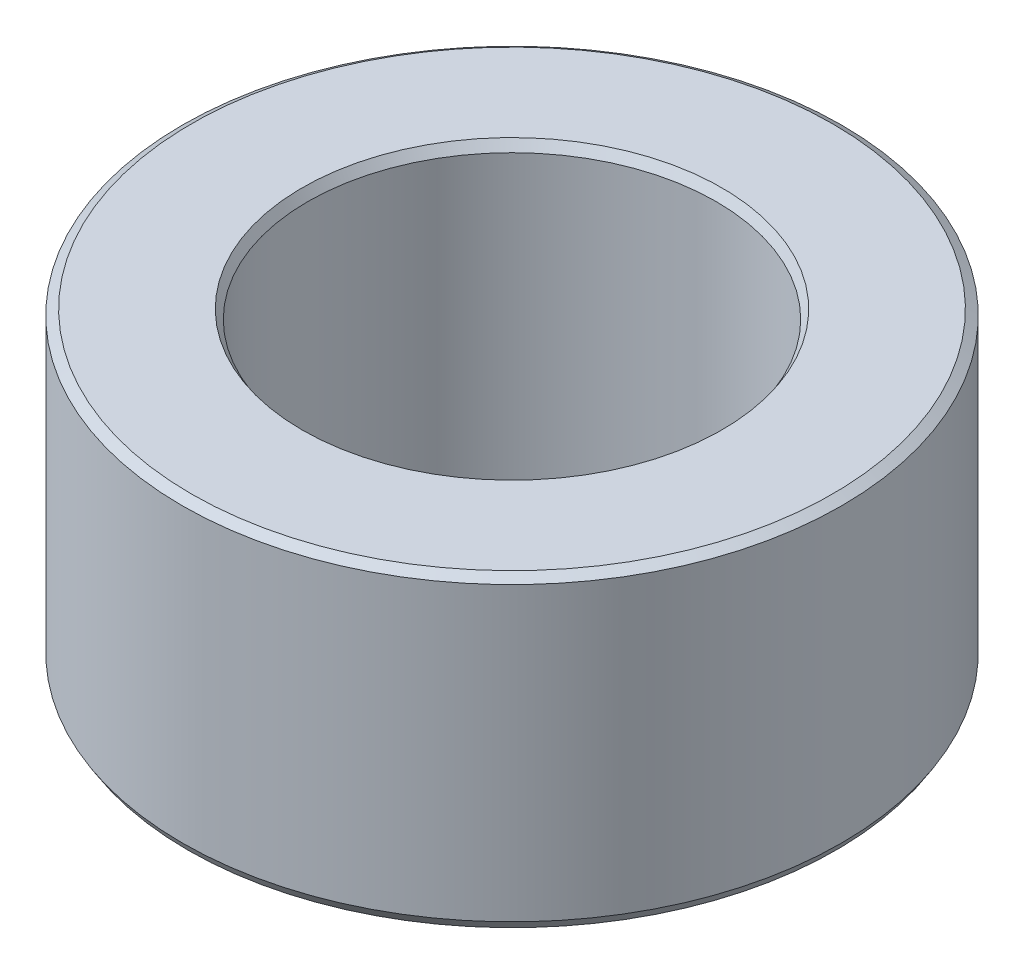
ISO-10303-21;
HEADER;
FILE_DESCRIPTION(('STEP AP214'),'2;1');
FILE_NAME('part.step','',(''),(''),'','','');
FILE_SCHEMA(('AUTOMOTIVE_DESIGN { 1 0 10303 214 1 1 1 1 }'));
ENDSEC;
DATA;
#1=APPLICATION_CONTEXT('core data for automotive mechanical design processes');
#2=APPLICATION_PROTOCOL_DEFINITION('international standard','automotive_design',2000,#1);
#3=PRODUCT_CONTEXT('',#1,'mechanical');
#4=PRODUCT('Part','Part','',(#3));
#5=PRODUCT_RELATED_PRODUCT_CATEGORY('part','',(#4));
#6=PRODUCT_DEFINITION_FORMATION('','',#4);
#7=PRODUCT_DEFINITION_CONTEXT('part definition',#1,'design');
#8=PRODUCT_DEFINITION('design','',#6,#7);
#9=PRODUCT_DEFINITION_SHAPE('','',#8);
#10=(LENGTH_UNIT() NAMED_UNIT(*) SI_UNIT(.MILLI.,.METRE.));
#11=(NAMED_UNIT(*) PLANE_ANGLE_UNIT() SI_UNIT($,.RADIAN.));
#12=(NAMED_UNIT(*) SI_UNIT($,.STERADIAN.) SOLID_ANGLE_UNIT());
#13=UNCERTAINTY_MEASURE_WITH_UNIT(LENGTH_MEASURE(1.E-05),#10,'distance_accuracy_value','');
#14=(GEOMETRIC_REPRESENTATION_CONTEXT(3) GLOBAL_UNCERTAINTY_ASSIGNED_CONTEXT((#13)) GLOBAL_UNIT_ASSIGNED_CONTEXT((#10,
#11,#12)) REPRESENTATION_CONTEXT('',''));
#15=CARTESIAN_POINT('',(0.,0.,0.));
#16=DIRECTION('',(0.,0.,1.));
#17=DIRECTION('',(1.,0.,0.));
#18=AXIS2_PLACEMENT_3D('',#15,#16,#17);
#19=CARTESIAN_POINT('',(0.,46.5250636387127,0.));
#20=DIRECTION('',(0.,-1.,0.));
#21=DIRECTION('',(0.,0.,-1.));
#22=AXIS2_PLACEMENT_3D('',#19,#20,#21);
#23=CYLINDRICAL_SURFACE('',#22,50.);
#24=CARTESIAN_POINT('',(0.,1.37868026472085,0.));
#25=DIRECTION('',(0.,1.,0.));
#26=DIRECTION('',(0.,0.,1.));
#27=AXIS2_PLACEMENT_3D('',#24,#25,#26);
#28=CIRCLE('',#27,50.);
#29=CARTESIAN_POINT('',(0.,1.37868026472085,50.));
#30=VERTEX_POINT('',#29);
#31=EDGE_CURVE('E10',#30,#30,#28,.T.);
#32=ORIENTED_EDGE('',*,*,#31,.T.);
#33=EDGE_LOOP('',(#32));
#34=FACE_BOUND('',#33,.T.);
#35=CARTESIAN_POINT('',(0.,45.666382704719,0.));
#36=DIRECTION('',(0.,1.,0.));
#37=DIRECTION('',(0.,0.,1.));
#38=AXIS2_PLACEMENT_3D('',#35,#36,#37);
#39=CIRCLE('',#38,50.);
#40=CARTESIAN_POINT('',(0.,45.666382704719,50.));
#41=VERTEX_POINT('',#40);
#42=EDGE_CURVE('E50',#41,#41,#39,.F.);
#43=ORIENTED_EDGE('',*,*,#42,.T.);
#44=EDGE_LOOP('',(#43));
#45=FACE_BOUND('',#44,.T.);
#46=ADVANCED_FACE('F39',(#34,#45),#23,.T.);
#47=CARTESIAN_POINT('',(0.,46.5250636387127,0.));
#48=DIRECTION('',(0.,1.,0.));
#49=DIRECTION('',(0.,0.,1.));
#50=AXIS2_PLACEMENT_3D('',#47,#48,#49);
#51=PLANE('',#50);
#52=CARTESIAN_POINT('',(0.,46.5250636387127,0.));
#53=DIRECTION('',(0.,1.,0.));
#54=DIRECTION('',(0.,0.,1.));
#55=AXIS2_PLACEMENT_3D('',#52,#53,#54);
#56=CIRCLE('',#55,31.8210176963023);
#57=CARTESIAN_POINT('',(0.,46.5250636387127,31.8210176963023));
#58=VERTEX_POINT('',#57);
#59=EDGE_CURVE('E58',#58,#58,#56,.F.);
#60=ORIENTED_EDGE('',*,*,#59,.T.);
#61=EDGE_LOOP('',(#60));
#62=FACE_BOUND('',#61,.T.);
#63=CARTESIAN_POINT('',(0.,46.5250636387127,0.));
#64=DIRECTION('',(0.,1.,0.));
#65=DIRECTION('',(0.,0.,1.));
#66=AXIS2_PLACEMENT_3D('',#63,#64,#65);
#67=CIRCLE('',#66,48.6213197352792);
#68=CARTESIAN_POINT('',(0.,46.5250636387127,48.6213197352792));
#69=VERTEX_POINT('',#68);
#70=EDGE_CURVE('E61',#69,#69,#67,.T.);
#71=ORIENTED_EDGE('',*,*,#70,.T.);
#72=EDGE_LOOP('',(#71));
#73=FACE_BOUND('',#72,.T.);
#74=ADVANCED_FACE('F88',(#62,#73),#51,.T.);
#75=CARTESIAN_POINT('',(0.,0.,0.));
#76=DIRECTION('',(0.,1.,0.));
#77=DIRECTION('',(0.,0.,1.));
#78=AXIS2_PLACEMENT_3D('',#75,#76,#77);
#79=PLANE('',#78);
#80=CARTESIAN_POINT('',(0.,0.,0.));
#81=DIRECTION('',(0.,1.,0.));
#82=DIRECTION('',(0.,0.,1.));
#83=AXIS2_PLACEMENT_3D('',#80,#81,#82);
#84=CIRCLE('',#83,32.3410170270295);
#85=CARTESIAN_POINT('',(0.,0.,32.3410170270295));
#86=VERTEX_POINT('',#85);
#87=EDGE_CURVE('E51',#86,#86,#84,.T.);
#88=ORIENTED_EDGE('',*,*,#87,.T.);
#89=EDGE_LOOP('',(#88));
#90=FACE_BOUND('',#89,.T.);
#91=CARTESIAN_POINT('',(0.,0.,0.));
#92=DIRECTION('',(0.,1.,0.));
#93=DIRECTION('',(0.,0.,1.));
#94=AXIS2_PLACEMENT_3D('',#91,#92,#93);
#95=CIRCLE('',#94,49.1413190660063);
#96=CARTESIAN_POINT('',(0.,0.,49.1413190660063));
#97=VERTEX_POINT('',#96);
#98=EDGE_CURVE('E54',#97,#97,#95,.F.);
#99=ORIENTED_EDGE('',*,*,#98,.T.);
#100=EDGE_LOOP('',(#99));
#101=FACE_BOUND('',#100,.T.);
#102=ADVANCED_FACE('F83',(#90,#101),#79,.F.);
#103=CARTESIAN_POINT('',(0.,46.5250636387127,0.));
#104=DIRECTION('',(0.,-1.,0.));
#105=DIRECTION('',(0.,0.,-1.));
#106=AXIS2_PLACEMENT_3D('',#103,#104,#105);
#107=CYLINDRICAL_SURFACE('',#106,30.9623367623087);
#108=CARTESIAN_POINT('',(0.,45.1463833739918,0.));
#109=DIRECTION('',(0.,1.,0.));
#110=DIRECTION('',(0.,0.,1.));
#111=AXIS2_PLACEMENT_3D('',#108,#109,#110);
#112=CIRCLE('',#111,30.9623367623087);
#113=CARTESIAN_POINT('',(0.,45.1463833739918,30.9623367623087));
#114=VERTEX_POINT('',#113);
#115=EDGE_CURVE('E67',#114,#114,#112,.T.);
#116=ORIENTED_EDGE('',*,*,#115,.T.);
#117=EDGE_LOOP('',(#116));
#118=FACE_BOUND('',#117,.T.);
#119=CARTESIAN_POINT('',(0.,0.858680933993647,0.));
#120=DIRECTION('',(0.,1.,0.));
#121=DIRECTION('',(0.,0.,1.));
#122=AXIS2_PLACEMENT_3D('',#119,#120,#121);
#123=CIRCLE('',#122,30.9623367623087);
#124=CARTESIAN_POINT('',(0.,0.858680933993647,30.9623367623087));
#125=VERTEX_POINT('',#124);
#126=EDGE_CURVE('E69',#125,#125,#123,.F.);
#127=ORIENTED_EDGE('',*,*,#126,.T.);
#128=EDGE_LOOP('',(#127));
#129=FACE_BOUND('',#128,.T.);
#130=ADVANCED_FACE('F71',(#118,#129),#107,.F.);
#131=CARTESIAN_POINT('',(0.,45.1463833739918,0.));
#132=DIRECTION('',(0.,1.,0.));
#133=DIRECTION('',(0.,0.,1.));
#134=AXIS2_PLACEMENT_3D('',#131,#132,#133);
#135=CONICAL_SURFACE('',#134,30.9623367623087,0.557036039767317);
#136=ORIENTED_EDGE('',*,*,#59,.F.);
#137=EDGE_LOOP('',(#136));
#138=FACE_BOUND('',#137,.T.);
#139=ORIENTED_EDGE('',*,*,#115,.F.);
#140=EDGE_LOOP('',(#139));
#141=FACE_BOUND('',#140,.T.);
#142=ADVANCED_FACE('F77',(#138,#141),#135,.F.);
#143=CARTESIAN_POINT('',(0.,0.,0.));
#144=DIRECTION('',(0.,-1.,0.));
#145=DIRECTION('',(0.,0.,-1.));
#146=AXIS2_PLACEMENT_3D('',#143,#144,#145);
#147=CONICAL_SURFACE('',#146,32.3410170270295,1.01376028702758);
#148=ORIENTED_EDGE('',*,*,#126,.F.);
#149=EDGE_LOOP('',(#148));
#150=FACE_BOUND('',#149,.T.);
#151=ORIENTED_EDGE('',*,*,#87,.F.);
#152=EDGE_LOOP('',(#151));
#153=FACE_BOUND('',#152,.T.);
#154=ADVANCED_FACE('F73',(#150,#153),#147,.F.);
#155=CARTESIAN_POINT('',(0.,1.37868026472085,0.));
#156=DIRECTION('',(0.,1.,0.));
#157=DIRECTION('',(0.,0.,1.));
#158=AXIS2_PLACEMENT_3D('',#155,#156,#157);
#159=CONICAL_SURFACE('',#158,50.,0.557036039767311);
#160=ORIENTED_EDGE('',*,*,#98,.F.);
#161=EDGE_LOOP('',(#160));
#162=FACE_BOUND('',#161,.T.);
#163=ORIENTED_EDGE('',*,*,#31,.F.);
#164=EDGE_LOOP('',(#163));
#165=FACE_BOUND('',#164,.T.);
#166=ADVANCED_FACE('F76',(#162,#165),#159,.T.);
#167=CARTESIAN_POINT('',(0.,46.5250636387127,0.));
#168=DIRECTION('',(0.,-1.,0.));
#169=DIRECTION('',(0.,0.,-1.));
#170=AXIS2_PLACEMENT_3D('',#167,#168,#169);
#171=CONICAL_SURFACE('',#170,48.6213197352792,1.01376028702758);
#172=ORIENTED_EDGE('',*,*,#42,.F.);
#173=EDGE_LOOP('',(#172));
#174=FACE_BOUND('',#173,.T.);
#175=ORIENTED_EDGE('',*,*,#70,.F.);
#176=EDGE_LOOP('',(#175));
#177=FACE_BOUND('',#176,.T.);
#178=ADVANCED_FACE('F45',(#174,#177),#171,.T.);
#179=CLOSED_SHELL('',(#46,#74,#102,#130,#142,#154,#166,#178));
#180=MANIFOLD_SOLID_BREP('B2',#179);
#181=ADVANCED_BREP_SHAPE_REPRESENTATION('',(#18,#180),#14);
#182=SHAPE_DEFINITION_REPRESENTATION(#9,#181);
ENDSEC;
END-ISO-10303-21;
